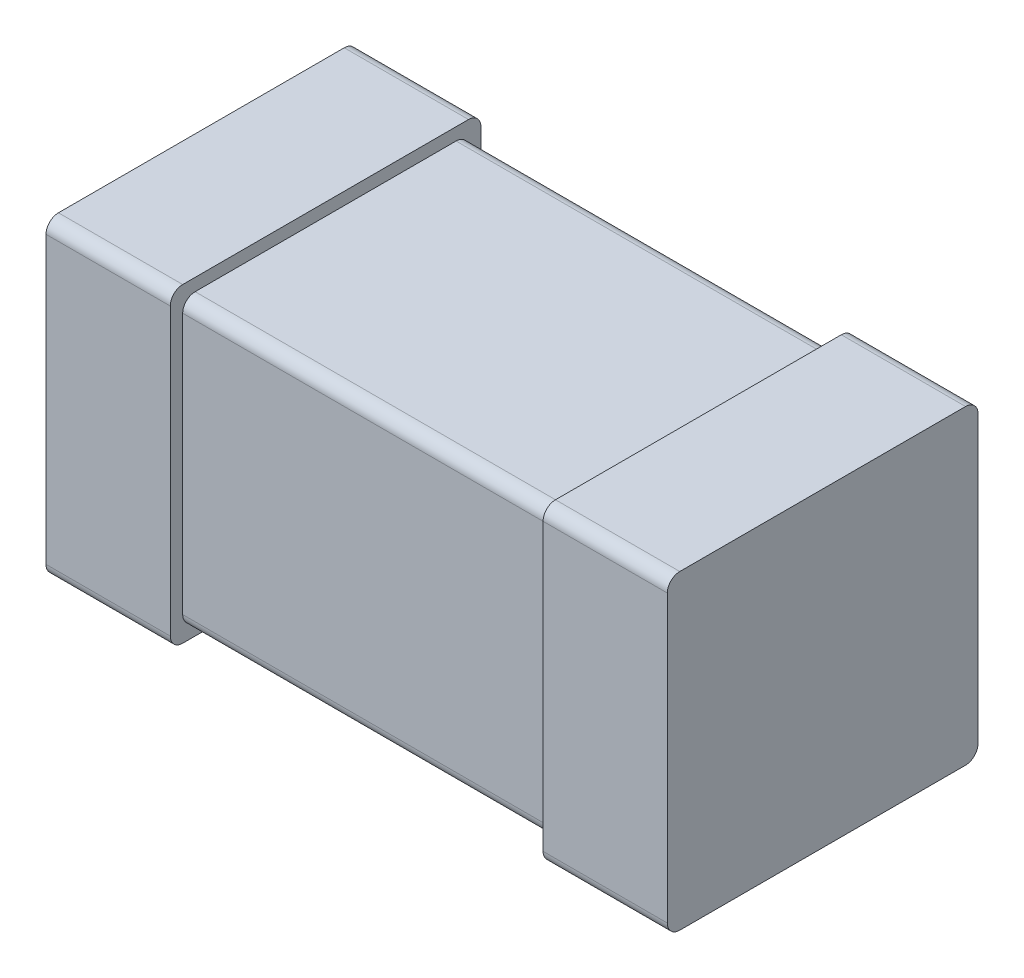
ISO-10303-21;
HEADER;
FILE_DESCRIPTION(('STEP AP214'),'2;1');
FILE_NAME('part.step','',(''),(''),'','','');
FILE_SCHEMA(('AUTOMOTIVE_DESIGN { 1 0 10303 214 1 1 1 1 }'));
ENDSEC;
DATA;
#1=APPLICATION_CONTEXT('core data for automotive mechanical design processes');
#2=APPLICATION_PROTOCOL_DEFINITION('international standard','automotive_design',2000,#1);
#3=PRODUCT_CONTEXT('',#1,'mechanical');
#4=PRODUCT('Part','Part','',(#3));
#5=PRODUCT_RELATED_PRODUCT_CATEGORY('part','',(#4));
#6=PRODUCT_DEFINITION_FORMATION('','',#4);
#7=PRODUCT_DEFINITION_CONTEXT('part definition',#1,'design');
#8=PRODUCT_DEFINITION('design','',#6,#7);
#9=PRODUCT_DEFINITION_SHAPE('','',#8);
#10=(LENGTH_UNIT() NAMED_UNIT(*) SI_UNIT(.MILLI.,.METRE.));
#11=(NAMED_UNIT(*) PLANE_ANGLE_UNIT() SI_UNIT($,.RADIAN.));
#12=(NAMED_UNIT(*) SI_UNIT($,.STERADIAN.) SOLID_ANGLE_UNIT());
#13=UNCERTAINTY_MEASURE_WITH_UNIT(LENGTH_MEASURE(1.E-05),#10,'distance_accuracy_value','');
#14=(GEOMETRIC_REPRESENTATION_CONTEXT(3) GLOBAL_UNCERTAINTY_ASSIGNED_CONTEXT((#13)) GLOBAL_UNIT_ASSIGNED_CONTEXT((#10,
#11,#12)) REPRESENTATION_CONTEXT('',''));
#15=CARTESIAN_POINT('',(0.,0.,0.));
#16=DIRECTION('',(0.,0.,1.));
#17=DIRECTION('',(1.,0.,0.));
#18=AXIS2_PLACEMENT_3D('',#15,#16,#17);
#19=CARTESIAN_POINT('',(-0.5,-0.23,0.02));
#20=DIRECTION('',(1.,0.,0.));
#21=DIRECTION('',(0.,0.,-1.));
#22=AXIS2_PLACEMENT_3D('',#19,#20,#21);
#23=CYLINDRICAL_SURFACE('',#22,0.02);
#24=CARTESIAN_POINT('',(-0.3,-0.23,0.02));
#25=DIRECTION('',(1.,0.,0.));
#26=DIRECTION('',(0.,0.,-1.));
#27=AXIS2_PLACEMENT_3D('',#24,#25,#26);
#28=CIRCLE('',#27,0.02);
#29=CARTESIAN_POINT('',(-0.3,-0.23,0.));
#30=VERTEX_POINT('',#29);
#31=CARTESIAN_POINT('',(-0.3,-0.25,0.02));
#32=VERTEX_POINT('',#31);
#33=EDGE_CURVE('E20',#30,#32,#28,.F.);
#34=ORIENTED_EDGE('',*,*,#33,.T.);
#35=DIRECTION('',(1.,0.,0.));
#36=VECTOR('',#35,1.);
#37=CARTESIAN_POINT('',(-0.5,-0.25,0.02));
#38=LINE('',#37,#36);
#39=CARTESIAN_POINT('',(-0.5,-0.25,0.02));
#40=VERTEX_POINT('',#39);
#41=EDGE_CURVE('E176',#32,#40,#38,.F.);
#42=ORIENTED_EDGE('',*,*,#41,.T.);
#43=CARTESIAN_POINT('',(-0.5,-0.23,0.02));
#44=DIRECTION('',(1.,0.,0.));
#45=DIRECTION('',(0.,0.,-1.));
#46=AXIS2_PLACEMENT_3D('',#43,#44,#45);
#47=CIRCLE('',#46,0.02);
#48=CARTESIAN_POINT('',(-0.5,-0.23,0.));
#49=VERTEX_POINT('',#48);
#50=EDGE_CURVE('E325',#40,#49,#47,.T.);
#51=ORIENTED_EDGE('',*,*,#50,.T.);
#52=DIRECTION('',(1.,0.,0.));
#53=VECTOR('',#52,1.);
#54=CARTESIAN_POINT('',(-0.5,-0.23,0.));
#55=LINE('',#54,#53);
#56=EDGE_CURVE('E178',#49,#30,#55,.T.);
#57=ORIENTED_EDGE('',*,*,#56,.T.);
#58=EDGE_LOOP('',(#34,#42,#51,#57));
#59=FACE_BOUND('',#58,.T.);
#60=ADVANCED_FACE('F17',(#59),#23,.T.);
#61=CARTESIAN_POINT('',(-0.5,0.23,0.02));
#62=DIRECTION('',(1.,0.,0.));
#63=DIRECTION('',(0.,0.,-1.));
#64=AXIS2_PLACEMENT_3D('',#61,#62,#63);
#65=CYLINDRICAL_SURFACE('',#64,0.02);
#66=DIRECTION('',(1.,0.,0.));
#67=VECTOR('',#66,1.);
#68=CARTESIAN_POINT('',(-0.5,0.23,0.));
#69=LINE('',#68,#67);
#70=CARTESIAN_POINT('',(-0.3,0.23,0.));
#71=VERTEX_POINT('',#70);
#72=CARTESIAN_POINT('',(-0.5,0.23,0.));
#73=VERTEX_POINT('',#72);
#74=EDGE_CURVE('E258',#71,#73,#69,.F.);
#75=ORIENTED_EDGE('',*,*,#74,.T.);
#76=CARTESIAN_POINT('',(-0.5,0.23,0.02));
#77=DIRECTION('',(1.,0.,0.));
#78=DIRECTION('',(0.,0.,-1.));
#79=AXIS2_PLACEMENT_3D('',#76,#77,#78);
#80=CIRCLE('',#79,0.02);
#81=CARTESIAN_POINT('',(-0.5,0.25,0.02));
#82=VERTEX_POINT('',#81);
#83=EDGE_CURVE('E322',#73,#82,#80,.T.);
#84=ORIENTED_EDGE('',*,*,#83,.T.);
#85=DIRECTION('',(1.,0.,0.));
#86=VECTOR('',#85,1.);
#87=CARTESIAN_POINT('',(-0.5,0.25,0.02));
#88=LINE('',#87,#86);
#89=CARTESIAN_POINT('',(-0.3,0.25,0.02));
#90=VERTEX_POINT('',#89);
#91=EDGE_CURVE('E255',#90,#82,#88,.F.);
#92=ORIENTED_EDGE('',*,*,#91,.F.);
#93=CARTESIAN_POINT('',(-0.3,0.23,0.02));
#94=DIRECTION('',(1.,0.,0.));
#95=DIRECTION('',(0.,0.,-1.));
#96=AXIS2_PLACEMENT_3D('',#93,#94,#95);
#97=CIRCLE('',#96,0.02);
#98=EDGE_CURVE('E180',#90,#71,#97,.F.);
#99=ORIENTED_EDGE('',*,*,#98,.T.);
#100=EDGE_LOOP('',(#75,#84,#92,#99));
#101=FACE_BOUND('',#100,.T.);
#102=ADVANCED_FACE('F329',(#101),#65,.T.);
#103=CARTESIAN_POINT('',(-0.5,-0.25,0.));
#104=DIRECTION('',(1.,0.,0.));
#105=DIRECTION('',(0.,0.,-1.));
#106=AXIS2_PLACEMENT_3D('',#103,#104,#105);
#107=PLANE('',#106);
#108=DIRECTION('',(0.,1.,0.));
#109=VECTOR('',#108,1.);
#110=CARTESIAN_POINT('',(-0.5,-0.25,0.5));
#111=LINE('',#110,#109);
#112=CARTESIAN_POINT('',(-0.5,0.23,0.5));
#113=VERTEX_POINT('',#112);
#114=CARTESIAN_POINT('',(-0.5,-0.23,0.5));
#115=VERTEX_POINT('',#114);
#116=EDGE_CURVE('E254',#113,#115,#111,.F.);
#117=ORIENTED_EDGE('',*,*,#116,.F.);
#118=CARTESIAN_POINT('',(-0.5,0.23,0.48));
#119=DIRECTION('',(1.,0.,0.));
#120=DIRECTION('',(0.,0.,-1.));
#121=AXIS2_PLACEMENT_3D('',#118,#119,#120);
#122=CIRCLE('',#121,0.02);
#123=CARTESIAN_POINT('',(-0.5,0.25,0.48));
#124=VERTEX_POINT('',#123);
#125=EDGE_CURVE('E317',#124,#113,#122,.T.);
#126=ORIENTED_EDGE('',*,*,#125,.F.);
#127=DIRECTION('',(0.,0.,1.));
#128=VECTOR('',#127,1.);
#129=CARTESIAN_POINT('',(-0.5,0.25,0.));
#130=LINE('',#129,#128);
#131=EDGE_CURVE('E257',#82,#124,#130,.T.);
#132=ORIENTED_EDGE('',*,*,#131,.F.);
#133=ORIENTED_EDGE('',*,*,#83,.F.);
#134=DIRECTION('',(0.,1.,0.));
#135=VECTOR('',#134,1.);
#136=CARTESIAN_POINT('',(-0.5,-0.25,0.));
#137=LINE('',#136,#135);
#138=EDGE_CURVE('E263',#73,#49,#137,.F.);
#139=ORIENTED_EDGE('',*,*,#138,.T.);
#140=ORIENTED_EDGE('',*,*,#50,.F.);
#141=DIRECTION('',(0.,0.,1.));
#142=VECTOR('',#141,1.);
#143=CARTESIAN_POINT('',(-0.5,-0.25,0.));
#144=LINE('',#143,#142);
#145=CARTESIAN_POINT('',(-0.5,-0.25,0.48));
#146=VERTEX_POINT('',#145);
#147=EDGE_CURVE('E188',#40,#146,#144,.T.);
#148=ORIENTED_EDGE('',*,*,#147,.T.);
#149=CARTESIAN_POINT('',(-0.5,-0.23,0.48));
#150=DIRECTION('',(1.,0.,0.));
#151=DIRECTION('',(0.,0.,-1.));
#152=AXIS2_PLACEMENT_3D('',#149,#150,#151);
#153=CIRCLE('',#152,0.02);
#154=EDGE_CURVE('E319',#115,#146,#153,.T.);
#155=ORIENTED_EDGE('',*,*,#154,.F.);
#156=EDGE_LOOP('',(#117,#126,#132,#133,#139,#140,#148,#155));
#157=FACE_BOUND('',#156,.T.);
#158=ADVANCED_FACE('F337',(#157),#107,.F.);
#159=CARTESIAN_POINT('',(-0.5,-0.23,0.48));
#160=DIRECTION('',(1.,0.,0.));
#161=DIRECTION('',(0.,0.,-1.));
#162=AXIS2_PLACEMENT_3D('',#159,#160,#161);
#163=CYLINDRICAL_SURFACE('',#162,0.02);
#164=DIRECTION('',(1.,0.,0.));
#165=VECTOR('',#164,1.);
#166=CARTESIAN_POINT('',(-0.5,-0.23,0.5));
#167=LINE('',#166,#165);
#168=CARTESIAN_POINT('',(-0.3,-0.23,0.5));
#169=VERTEX_POINT('',#168);
#170=EDGE_CURVE('E251',#115,#169,#167,.T.);
#171=ORIENTED_EDGE('',*,*,#170,.F.);
#172=ORIENTED_EDGE('',*,*,#154,.T.);
#173=DIRECTION('',(1.,0.,0.));
#174=VECTOR('',#173,1.);
#175=CARTESIAN_POINT('',(-0.5,-0.25,0.48));
#176=LINE('',#175,#174);
#177=CARTESIAN_POINT('',(-0.3,-0.25,0.48));
#178=VERTEX_POINT('',#177);
#179=EDGE_CURVE('E266',#146,#178,#176,.T.);
#180=ORIENTED_EDGE('',*,*,#179,.T.);
#181=CARTESIAN_POINT('',(-0.3,-0.23,0.48));
#182=DIRECTION('',(1.,0.,0.));
#183=DIRECTION('',(0.,0.,-1.));
#184=AXIS2_PLACEMENT_3D('',#181,#182,#183);
#185=CIRCLE('',#184,0.02);
#186=EDGE_CURVE('E193',#178,#169,#185,.F.);
#187=ORIENTED_EDGE('',*,*,#186,.T.);
#188=EDGE_LOOP('',(#171,#172,#180,#187));
#189=FACE_BOUND('',#188,.T.);
#190=ADVANCED_FACE('F480',(#189),#163,.T.);
#191=CARTESIAN_POINT('',(-0.5,0.23,0.48));
#192=DIRECTION('',(1.,0.,0.));
#193=DIRECTION('',(0.,0.,-1.));
#194=AXIS2_PLACEMENT_3D('',#191,#192,#193);
#195=CYLINDRICAL_SURFACE('',#194,0.02);
#196=CARTESIAN_POINT('',(-0.3,0.23,0.48));
#197=DIRECTION('',(1.,0.,0.));
#198=DIRECTION('',(0.,0.,-1.));
#199=AXIS2_PLACEMENT_3D('',#196,#197,#198);
#200=CIRCLE('',#199,0.02);
#201=CARTESIAN_POINT('',(-0.3,0.23,0.5));
#202=VERTEX_POINT('',#201);
#203=CARTESIAN_POINT('',(-0.3,0.25,0.48));
#204=VERTEX_POINT('',#203);
#205=EDGE_CURVE('E315',#202,#204,#200,.F.);
#206=ORIENTED_EDGE('',*,*,#205,.T.);
#207=DIRECTION('',(1.,0.,0.));
#208=VECTOR('',#207,1.);
#209=CARTESIAN_POINT('',(-0.5,0.25,0.48));
#210=LINE('',#209,#208);
#211=EDGE_CURVE('E259',#124,#204,#210,.T.);
#212=ORIENTED_EDGE('',*,*,#211,.F.);
#213=ORIENTED_EDGE('',*,*,#125,.T.);
#214=DIRECTION('',(1.,0.,0.));
#215=VECTOR('',#214,1.);
#216=CARTESIAN_POINT('',(-0.5,0.23,0.5));
#217=LINE('',#216,#215);
#218=EDGE_CURVE('E248',#202,#113,#217,.F.);
#219=ORIENTED_EDGE('',*,*,#218,.F.);
#220=EDGE_LOOP('',(#206,#212,#213,#219));
#221=FACE_BOUND('',#220,.T.);
#222=ADVANCED_FACE('F476',(#221),#195,.T.);
#223=CARTESIAN_POINT('',(0.3,-0.23,0.02));
#224=DIRECTION('',(1.,0.,0.));
#225=DIRECTION('',(0.,0.,-1.));
#226=AXIS2_PLACEMENT_3D('',#223,#224,#225);
#227=CYLINDRICAL_SURFACE('',#226,0.02);
#228=CARTESIAN_POINT('',(0.5,-0.23,0.02));
#229=DIRECTION('',(1.,0.,0.));
#230=DIRECTION('',(0.,0.,-1.));
#231=AXIS2_PLACEMENT_3D('',#228,#229,#230);
#232=CIRCLE('',#231,0.02);
#233=CARTESIAN_POINT('',(0.5,-0.25,0.02));
#234=VERTEX_POINT('',#233);
#235=CARTESIAN_POINT('',(0.5,-0.23,0.));
#236=VERTEX_POINT('',#235);
#237=EDGE_CURVE('E307',#234,#236,#232,.T.);
#238=ORIENTED_EDGE('',*,*,#237,.F.);
#239=DIRECTION('',(1.,0.,0.));
#240=VECTOR('',#239,1.);
#241=CARTESIAN_POINT('',(0.3,-0.25,0.02));
#242=LINE('',#241,#240);
#243=CARTESIAN_POINT('',(0.3,-0.25,0.02));
#244=VERTEX_POINT('',#243);
#245=EDGE_CURVE('E244',#234,#244,#242,.F.);
#246=ORIENTED_EDGE('',*,*,#245,.T.);
#247=CARTESIAN_POINT('',(0.3,-0.23,0.02));
#248=DIRECTION('',(1.,0.,0.));
#249=DIRECTION('',(0.,0.,-1.));
#250=AXIS2_PLACEMENT_3D('',#247,#248,#249);
#251=CIRCLE('',#250,0.02);
#252=CARTESIAN_POINT('',(0.3,-0.23,0.));
#253=VERTEX_POINT('',#252);
#254=EDGE_CURVE('E313',#244,#253,#251,.T.);
#255=ORIENTED_EDGE('',*,*,#254,.T.);
#256=DIRECTION('',(1.,0.,0.));
#257=VECTOR('',#256,1.);
#258=CARTESIAN_POINT('',(0.3,-0.23,0.));
#259=LINE('',#258,#257);
#260=EDGE_CURVE('E234',#253,#236,#259,.T.);
#261=ORIENTED_EDGE('',*,*,#260,.T.);
#262=EDGE_LOOP('',(#238,#246,#255,#261));
#263=FACE_BOUND('',#262,.T.);
#264=ADVANCED_FACE('F472',(#263),#227,.T.);
#265=CARTESIAN_POINT('',(0.3,0.23,0.02));
#266=DIRECTION('',(1.,0.,0.));
#267=DIRECTION('',(0.,0.,-1.));
#268=AXIS2_PLACEMENT_3D('',#265,#266,#267);
#269=CYLINDRICAL_SURFACE('',#268,0.02);
#270=DIRECTION('',(1.,0.,0.));
#271=VECTOR('',#270,1.);
#272=CARTESIAN_POINT('',(0.3,0.23,0.));
#273=LINE('',#272,#271);
#274=CARTESIAN_POINT('',(0.5,0.23,0.));
#275=VERTEX_POINT('',#274);
#276=CARTESIAN_POINT('',(0.3,0.23,0.));
#277=VERTEX_POINT('',#276);
#278=EDGE_CURVE('E239',#275,#277,#273,.F.);
#279=ORIENTED_EDGE('',*,*,#278,.T.);
#280=CARTESIAN_POINT('',(0.3,0.23,0.02));
#281=DIRECTION('',(1.,0.,0.));
#282=DIRECTION('',(0.,0.,-1.));
#283=AXIS2_PLACEMENT_3D('',#280,#281,#282);
#284=CIRCLE('',#283,0.02);
#285=CARTESIAN_POINT('',(0.3,0.25,0.02));
#286=VERTEX_POINT('',#285);
#287=EDGE_CURVE('E311',#277,#286,#284,.T.);
#288=ORIENTED_EDGE('',*,*,#287,.T.);
#289=DIRECTION('',(1.,0.,0.));
#290=VECTOR('',#289,1.);
#291=CARTESIAN_POINT('',(0.3,0.25,0.02));
#292=LINE('',#291,#290);
#293=CARTESIAN_POINT('',(0.5,0.25,0.02));
#294=VERTEX_POINT('',#293);
#295=EDGE_CURVE('E228',#294,#286,#292,.F.);
#296=ORIENTED_EDGE('',*,*,#295,.F.);
#297=CARTESIAN_POINT('',(0.5,0.23,0.02));
#298=DIRECTION('',(1.,0.,0.));
#299=DIRECTION('',(0.,0.,-1.));
#300=AXIS2_PLACEMENT_3D('',#297,#298,#299);
#301=CIRCLE('',#300,0.02);
#302=EDGE_CURVE('E305',#275,#294,#301,.T.);
#303=ORIENTED_EDGE('',*,*,#302,.F.);
#304=EDGE_LOOP('',(#279,#288,#296,#303));
#305=FACE_BOUND('',#304,.T.);
#306=ADVANCED_FACE('F468',(#305),#269,.T.);
#307=CARTESIAN_POINT('',(0.3,-0.23,0.48));
#308=DIRECTION('',(1.,0.,0.));
#309=DIRECTION('',(0.,0.,-1.));
#310=AXIS2_PLACEMENT_3D('',#307,#308,#309);
#311=CYLINDRICAL_SURFACE('',#310,0.02);
#312=DIRECTION('',(1.,0.,0.));
#313=VECTOR('',#312,1.);
#314=CARTESIAN_POINT('',(0.3,-0.23,0.5));
#315=LINE('',#314,#313);
#316=CARTESIAN_POINT('',(0.3,-0.23,0.5));
#317=VERTEX_POINT('',#316);
#318=CARTESIAN_POINT('',(0.5,-0.23,0.5));
#319=VERTEX_POINT('',#318);
#320=EDGE_CURVE('E225',#317,#319,#315,.T.);
#321=ORIENTED_EDGE('',*,*,#320,.F.);
#322=CARTESIAN_POINT('',(0.3,-0.23,0.48));
#323=DIRECTION('',(1.,0.,0.));
#324=DIRECTION('',(0.,0.,-1.));
#325=AXIS2_PLACEMENT_3D('',#322,#323,#324);
#326=CIRCLE('',#325,0.02);
#327=CARTESIAN_POINT('',(0.3,-0.25,0.48));
#328=VERTEX_POINT('',#327);
#329=EDGE_CURVE('E309',#317,#328,#326,.T.);
#330=ORIENTED_EDGE('',*,*,#329,.T.);
#331=DIRECTION('',(1.,0.,0.));
#332=VECTOR('',#331,1.);
#333=CARTESIAN_POINT('',(0.3,-0.25,0.48));
#334=LINE('',#333,#332);
#335=CARTESIAN_POINT('',(0.5,-0.25,0.48));
#336=VERTEX_POINT('',#335);
#337=EDGE_CURVE('E238',#328,#336,#334,.T.);
#338=ORIENTED_EDGE('',*,*,#337,.T.);
#339=CARTESIAN_POINT('',(0.5,-0.23,0.48));
#340=DIRECTION('',(1.,0.,0.));
#341=DIRECTION('',(0.,0.,-1.));
#342=AXIS2_PLACEMENT_3D('',#339,#340,#341);
#343=CIRCLE('',#342,0.02);
#344=EDGE_CURVE('E303',#319,#336,#343,.T.);
#345=ORIENTED_EDGE('',*,*,#344,.F.);
#346=EDGE_LOOP('',(#321,#330,#338,#345));
#347=FACE_BOUND('',#346,.T.);
#348=ADVANCED_FACE('F464',(#347),#311,.T.);
#349=CARTESIAN_POINT('',(0.5,-0.25,0.));
#350=DIRECTION('',(1.,0.,0.));
#351=DIRECTION('',(0.,0.,-1.));
#352=AXIS2_PLACEMENT_3D('',#349,#350,#351);
#353=PLANE('',#352);
#354=DIRECTION('',(0.,1.,0.));
#355=VECTOR('',#354,1.);
#356=CARTESIAN_POINT('',(0.5,-0.25,0.5));
#357=LINE('',#356,#355);
#358=CARTESIAN_POINT('',(0.5,0.23,0.5));
#359=VERTEX_POINT('',#358);
#360=EDGE_CURVE('E224',#319,#359,#357,.T.);
#361=ORIENTED_EDGE('',*,*,#360,.F.);
#362=ORIENTED_EDGE('',*,*,#344,.T.);
#363=DIRECTION('',(0.,0.,1.));
#364=VECTOR('',#363,1.);
#365=CARTESIAN_POINT('',(0.5,-0.25,0.));
#366=LINE('',#365,#364);
#367=EDGE_CURVE('E247',#336,#234,#366,.F.);
#368=ORIENTED_EDGE('',*,*,#367,.T.);
#369=ORIENTED_EDGE('',*,*,#237,.T.);
#370=DIRECTION('',(0.,1.,0.));
#371=VECTOR('',#370,1.);
#372=CARTESIAN_POINT('',(0.5,-0.25,0.));
#373=LINE('',#372,#371);
#374=EDGE_CURVE('E237',#236,#275,#373,.T.);
#375=ORIENTED_EDGE('',*,*,#374,.T.);
#376=ORIENTED_EDGE('',*,*,#302,.T.);
#377=DIRECTION('',(0.,0.,1.));
#378=VECTOR('',#377,1.);
#379=CARTESIAN_POINT('',(0.5,0.25,0.));
#380=LINE('',#379,#378);
#381=CARTESIAN_POINT('',(0.5,0.25,0.48));
#382=VERTEX_POINT('',#381);
#383=EDGE_CURVE('E231',#382,#294,#380,.F.);
#384=ORIENTED_EDGE('',*,*,#383,.F.);
#385=CARTESIAN_POINT('',(0.5,0.23,0.48));
#386=DIRECTION('',(1.,0.,0.));
#387=DIRECTION('',(0.,0.,-1.));
#388=AXIS2_PLACEMENT_3D('',#385,#386,#387);
#389=CIRCLE('',#388,0.02);
#390=EDGE_CURVE('E299',#359,#382,#389,.F.);
#391=ORIENTED_EDGE('',*,*,#390,.F.);
#392=EDGE_LOOP('',(#361,#362,#368,#369,#375,#376,#384,#391));
#393=FACE_BOUND('',#392,.T.);
#394=ADVANCED_FACE('F460',(#393),#353,.T.);
#395=CARTESIAN_POINT('',(0.3,0.23,0.48));
#396=DIRECTION('',(1.,0.,0.));
#397=DIRECTION('',(0.,0.,-1.));
#398=AXIS2_PLACEMENT_3D('',#395,#396,#397);
#399=CYLINDRICAL_SURFACE('',#398,0.02);
#400=ORIENTED_EDGE('',*,*,#390,.T.);
#401=DIRECTION('',(1.,0.,0.));
#402=VECTOR('',#401,1.);
#403=CARTESIAN_POINT('',(0.3,0.25,0.48));
#404=LINE('',#403,#402);
#405=CARTESIAN_POINT('',(0.3,0.25,0.48));
#406=VERTEX_POINT('',#405);
#407=EDGE_CURVE('E227',#406,#382,#404,.T.);
#408=ORIENTED_EDGE('',*,*,#407,.F.);
#409=CARTESIAN_POINT('',(0.3,0.23,0.48));
#410=DIRECTION('',(1.,0.,0.));
#411=DIRECTION('',(0.,0.,-1.));
#412=AXIS2_PLACEMENT_3D('',#409,#410,#411);
#413=CIRCLE('',#412,0.02);
#414=CARTESIAN_POINT('',(0.3,0.23,0.5));
#415=VERTEX_POINT('',#414);
#416=EDGE_CURVE('E301',#406,#415,#413,.T.);
#417=ORIENTED_EDGE('',*,*,#416,.T.);
#418=DIRECTION('',(1.,0.,0.));
#419=VECTOR('',#418,1.);
#420=CARTESIAN_POINT('',(0.3,0.23,0.5));
#421=LINE('',#420,#419);
#422=EDGE_CURVE('E216',#359,#415,#421,.F.);
#423=ORIENTED_EDGE('',*,*,#422,.F.);
#424=EDGE_LOOP('',(#400,#408,#417,#423));
#425=FACE_BOUND('',#424,.T.);
#426=ADVANCED_FACE('F456',(#425),#399,.T.);
#427=CARTESIAN_POINT('',(-0.3,-0.21,0.46));
#428=DIRECTION('',(1.,0.,0.));
#429=DIRECTION('',(0.,0.,-1.));
#430=AXIS2_PLACEMENT_3D('',#427,#428,#429);
#431=CYLINDRICAL_SURFACE('',#430,0.02);
#432=DIRECTION('',(1.,0.,0.));
#433=VECTOR('',#432,1.);
#434=CARTESIAN_POINT('',(-0.3,-0.21,0.48));
#435=LINE('',#434,#433);
#436=CARTESIAN_POINT('',(-0.3,-0.21,0.48));
#437=VERTEX_POINT('',#436);
#438=CARTESIAN_POINT('',(0.3,-0.21,0.48));
#439=VERTEX_POINT('',#438);
#440=EDGE_CURVE('E208',#437,#439,#435,.T.);
#441=ORIENTED_EDGE('',*,*,#440,.F.);
#442=CARTESIAN_POINT('',(-0.3,-0.21,0.46));
#443=DIRECTION('',(1.,0.,0.));
#444=DIRECTION('',(0.,0.,-1.));
#445=AXIS2_PLACEMENT_3D('',#442,#443,#444);
#446=CIRCLE('',#445,0.02);
#447=CARTESIAN_POINT('',(-0.3,-0.23,0.46));
#448=VERTEX_POINT('',#447);
#449=EDGE_CURVE('E295',#437,#448,#446,.T.);
#450=ORIENTED_EDGE('',*,*,#449,.T.);
#451=DIRECTION('',(1.,0.,0.));
#452=VECTOR('',#451,1.);
#453=CARTESIAN_POINT('',(-0.3,-0.23,0.46));
#454=LINE('',#453,#452);
#455=CARTESIAN_POINT('',(0.3,-0.23,0.46));
#456=VERTEX_POINT('',#455);
#457=EDGE_CURVE('E211',#448,#456,#454,.T.);
#458=ORIENTED_EDGE('',*,*,#457,.T.);
#459=CARTESIAN_POINT('',(0.3,-0.21,0.46));
#460=DIRECTION('',(1.,0.,0.));
#461=DIRECTION('',(0.,0.,-1.));
#462=AXIS2_PLACEMENT_3D('',#459,#460,#461);
#463=CIRCLE('',#462,0.02);
#464=EDGE_CURVE('E297',#456,#439,#463,.F.);
#465=ORIENTED_EDGE('',*,*,#464,.T.);
#466=EDGE_LOOP('',(#441,#450,#458,#465));
#467=FACE_BOUND('',#466,.T.);
#468=ADVANCED_FACE('F452',(#467),#431,.T.);
#469=CARTESIAN_POINT('',(-0.3,0.21,0.46));
#470=DIRECTION('',(1.,0.,0.));
#471=DIRECTION('',(0.,0.,-1.));
#472=AXIS2_PLACEMENT_3D('',#469,#470,#471);
#473=CYLINDRICAL_SURFACE('',#472,0.02);
#474=CARTESIAN_POINT('',(0.3,0.21,0.46));
#475=DIRECTION('',(1.,0.,0.));
#476=DIRECTION('',(0.,0.,-1.));
#477=AXIS2_PLACEMENT_3D('',#474,#475,#476);
#478=CIRCLE('',#477,0.02);
#479=CARTESIAN_POINT('',(0.3,0.21,0.48));
#480=VERTEX_POINT('',#479);
#481=CARTESIAN_POINT('',(0.3,0.23,0.46));
#482=VERTEX_POINT('',#481);
#483=EDGE_CURVE('E189',#480,#482,#478,.F.);
#484=ORIENTED_EDGE('',*,*,#483,.T.);
#485=DIRECTION('',(1.,0.,0.));
#486=VECTOR('',#485,1.);
#487=CARTESIAN_POINT('',(-0.3,0.23,0.46));
#488=LINE('',#487,#486);
#489=CARTESIAN_POINT('',(-0.3,0.23,0.46));
#490=VERTEX_POINT('',#489);
#491=EDGE_CURVE('E196',#490,#482,#488,.T.);
#492=ORIENTED_EDGE('',*,*,#491,.F.);
#493=CARTESIAN_POINT('',(-0.3,0.21,0.46));
#494=DIRECTION('',(1.,0.,0.));
#495=DIRECTION('',(0.,0.,-1.));
#496=AXIS2_PLACEMENT_3D('',#493,#494,#495);
#497=CIRCLE('',#496,0.02);
#498=CARTESIAN_POINT('',(-0.3,0.21,0.48));
#499=VERTEX_POINT('',#498);
#500=EDGE_CURVE('E293',#490,#499,#497,.T.);
#501=ORIENTED_EDGE('',*,*,#500,.T.);
#502=DIRECTION('',(1.,0.,0.));
#503=VECTOR('',#502,1.);
#504=CARTESIAN_POINT('',(-0.3,0.21,0.48));
#505=LINE('',#504,#503);
#506=EDGE_CURVE('E201',#480,#499,#505,.F.);
#507=ORIENTED_EDGE('',*,*,#506,.F.);
#508=EDGE_LOOP('',(#484,#492,#501,#507));
#509=FACE_BOUND('',#508,.T.);
#510=ADVANCED_FACE('F449',(#509),#473,.T.);
#511=CARTESIAN_POINT('',(-0.5,-0.25,0.));
#512=DIRECTION('',(0.,1.,0.));
#513=DIRECTION('',(0.,0.,1.));
#514=AXIS2_PLACEMENT_3D('',#511,#512,#513);
#515=PLANE('',#514);
#516=ORIENTED_EDGE('',*,*,#147,.F.);
#517=ORIENTED_EDGE('',*,*,#41,.F.);
#518=DIRECTION('',(0.,0.,-1.));
#519=VECTOR('',#518,1.);
#520=CARTESIAN_POINT('',(-0.3,-0.25,0.));
#521=LINE('',#520,#519);
#522=EDGE_CURVE('E186',#178,#32,#521,.T.);
#523=ORIENTED_EDGE('',*,*,#522,.F.);
#524=ORIENTED_EDGE('',*,*,#179,.F.);
#525=EDGE_LOOP('',(#516,#517,#523,#524));
#526=FACE_BOUND('',#525,.T.);
#527=ADVANCED_FACE('F184',(#526),#515,.F.);
#528=CARTESIAN_POINT('',(-0.5,-0.25,0.));
#529=DIRECTION('',(0.,0.,1.));
#530=DIRECTION('',(1.,0.,0.));
#531=AXIS2_PLACEMENT_3D('',#528,#529,#530);
#532=PLANE('',#531);
#533=DIRECTION('',(0.,1.,0.));
#534=VECTOR('',#533,1.);
#535=CARTESIAN_POINT('',(-0.3,-0.25,0.));
#536=LINE('',#535,#534);
#537=EDGE_CURVE('E195',#30,#71,#536,.T.);
#538=ORIENTED_EDGE('',*,*,#537,.F.);
#539=ORIENTED_EDGE('',*,*,#56,.F.);
#540=ORIENTED_EDGE('',*,*,#138,.F.);
#541=ORIENTED_EDGE('',*,*,#74,.F.);
#542=EDGE_LOOP('',(#538,#539,#540,#541));
#543=FACE_BOUND('',#542,.T.);
#544=ADVANCED_FACE('F334',(#543),#532,.F.);
#545=CARTESIAN_POINT('',(-0.5,0.25,0.));
#546=DIRECTION('',(0.,1.,0.));
#547=DIRECTION('',(0.,0.,1.));
#548=AXIS2_PLACEMENT_3D('',#545,#546,#547);
#549=PLANE('',#548);
#550=ORIENTED_EDGE('',*,*,#131,.T.);
#551=ORIENTED_EDGE('',*,*,#211,.T.);
#552=DIRECTION('',(0.,0.,-1.));
#553=VECTOR('',#552,1.);
#554=CARTESIAN_POINT('',(-0.3,0.25,0.));
#555=LINE('',#554,#553);
#556=EDGE_CURVE('E198',#90,#204,#555,.F.);
#557=ORIENTED_EDGE('',*,*,#556,.F.);
#558=ORIENTED_EDGE('',*,*,#91,.T.);
#559=EDGE_LOOP('',(#550,#551,#557,#558));
#560=FACE_BOUND('',#559,.T.);
#561=ADVANCED_FACE('F342',(#560),#549,.T.);
#562=CARTESIAN_POINT('',(-0.5,-0.25,0.5));
#563=DIRECTION('',(0.,0.,1.));
#564=DIRECTION('',(1.,0.,0.));
#565=AXIS2_PLACEMENT_3D('',#562,#563,#564);
#566=PLANE('',#565);
#567=DIRECTION('',(0.,1.,0.));
#568=VECTOR('',#567,1.);
#569=CARTESIAN_POINT('',(-0.3,-0.25,0.5));
#570=LINE('',#569,#568);
#571=EDGE_CURVE('E343',#202,#169,#570,.F.);
#572=ORIENTED_EDGE('',*,*,#571,.F.);
#573=ORIENTED_EDGE('',*,*,#218,.T.);
#574=ORIENTED_EDGE('',*,*,#116,.T.);
#575=ORIENTED_EDGE('',*,*,#170,.T.);
#576=EDGE_LOOP('',(#572,#573,#574,#575));
#577=FACE_BOUND('',#576,.T.);
#578=ADVANCED_FACE('F438',(#577),#566,.T.);
#579=CARTESIAN_POINT('',(0.3,-0.25,0.));
#580=DIRECTION('',(0.,1.,0.));
#581=DIRECTION('',(0.,0.,1.));
#582=AXIS2_PLACEMENT_3D('',#579,#580,#581);
#583=PLANE('',#582);
#584=DIRECTION('',(0.,0.,-1.));
#585=VECTOR('',#584,1.);
#586=CARTESIAN_POINT('',(0.3,-0.25,0.));
#587=LINE('',#586,#585);
#588=EDGE_CURVE('E220',#328,#244,#587,.T.);
#589=ORIENTED_EDGE('',*,*,#588,.T.);
#590=ORIENTED_EDGE('',*,*,#245,.F.);
#591=ORIENTED_EDGE('',*,*,#367,.F.);
#592=ORIENTED_EDGE('',*,*,#337,.F.);
#593=EDGE_LOOP('',(#589,#590,#591,#592));
#594=FACE_BOUND('',#593,.T.);
#595=ADVANCED_FACE('F434',(#594),#583,.F.);
#596=CARTESIAN_POINT('',(0.3,-0.25,0.));
#597=DIRECTION('',(0.,0.,1.));
#598=DIRECTION('',(1.,0.,0.));
#599=AXIS2_PLACEMENT_3D('',#596,#597,#598);
#600=PLANE('',#599);
#601=ORIENTED_EDGE('',*,*,#374,.F.);
#602=ORIENTED_EDGE('',*,*,#260,.F.);
#603=DIRECTION('',(0.,1.,0.));
#604=VECTOR('',#603,1.);
#605=CARTESIAN_POINT('',(0.3,-0.25,0.));
#606=LINE('',#605,#604);
#607=EDGE_CURVE('E363',#253,#277,#606,.T.);
#608=ORIENTED_EDGE('',*,*,#607,.T.);
#609=ORIENTED_EDGE('',*,*,#278,.F.);
#610=EDGE_LOOP('',(#601,#602,#608,#609));
#611=FACE_BOUND('',#610,.T.);
#612=ADVANCED_FACE('F430',(#611),#600,.F.);
#613=CARTESIAN_POINT('',(0.3,0.25,0.));
#614=DIRECTION('',(0.,1.,0.));
#615=DIRECTION('',(0.,0.,1.));
#616=AXIS2_PLACEMENT_3D('',#613,#614,#615);
#617=PLANE('',#616);
#618=DIRECTION('',(0.,0.,-1.));
#619=VECTOR('',#618,1.);
#620=CARTESIAN_POINT('',(0.3,0.25,0.));
#621=LINE('',#620,#619);
#622=EDGE_CURVE('E366',#286,#406,#621,.F.);
#623=ORIENTED_EDGE('',*,*,#622,.T.);
#624=ORIENTED_EDGE('',*,*,#407,.T.);
#625=ORIENTED_EDGE('',*,*,#383,.T.);
#626=ORIENTED_EDGE('',*,*,#295,.T.);
#627=EDGE_LOOP('',(#623,#624,#625,#626));
#628=FACE_BOUND('',#627,.T.);
#629=ADVANCED_FACE('F426',(#628),#617,.T.);
#630=CARTESIAN_POINT('',(0.3,-0.25,0.5));
#631=DIRECTION('',(0.,0.,1.));
#632=DIRECTION('',(1.,0.,0.));
#633=AXIS2_PLACEMENT_3D('',#630,#631,#632);
#634=PLANE('',#633);
#635=ORIENTED_EDGE('',*,*,#360,.T.);
#636=ORIENTED_EDGE('',*,*,#422,.T.);
#637=DIRECTION('',(0.,1.,0.));
#638=VECTOR('',#637,1.);
#639=CARTESIAN_POINT('',(0.3,-0.25,0.5));
#640=LINE('',#639,#638);
#641=EDGE_CURVE('E289',#415,#317,#640,.F.);
#642=ORIENTED_EDGE('',*,*,#641,.T.);
#643=ORIENTED_EDGE('',*,*,#320,.T.);
#644=EDGE_LOOP('',(#635,#636,#642,#643));
#645=FACE_BOUND('',#644,.T.);
#646=ADVANCED_FACE('F422',(#645),#634,.T.);
#647=CARTESIAN_POINT('',(-0.3,-0.23,0.02));
#648=DIRECTION('',(0.,1.,0.));
#649=DIRECTION('',(0.,0.,1.));
#650=AXIS2_PLACEMENT_3D('',#647,#648,#649);
#651=PLANE('',#650);
#652=DIRECTION('',(0.,0.,-1.));
#653=VECTOR('',#652,1.);
#654=CARTESIAN_POINT('',(-0.3,-0.23,0.));
#655=LINE('',#654,#653);
#656=CARTESIAN_POINT('',(-0.3,-0.23,0.04));
#657=VERTEX_POINT('',#656);
#658=EDGE_CURVE('E344',#657,#448,#655,.F.);
#659=ORIENTED_EDGE('',*,*,#658,.F.);
#660=DIRECTION('',(1.,0.,0.));
#661=VECTOR('',#660,1.);
#662=CARTESIAN_POINT('',(-0.3,-0.23,0.04));
#663=LINE('',#662,#661);
#664=CARTESIAN_POINT('',(0.3,-0.23,0.04));
#665=VERTEX_POINT('',#664);
#666=EDGE_CURVE('E217',#665,#657,#663,.F.);
#667=ORIENTED_EDGE('',*,*,#666,.F.);
#668=DIRECTION('',(0.,0.,-1.));
#669=VECTOR('',#668,1.);
#670=CARTESIAN_POINT('',(0.3,-0.23,0.));
#671=LINE('',#670,#669);
#672=EDGE_CURVE('E288',#665,#456,#671,.F.);
#673=ORIENTED_EDGE('',*,*,#672,.T.);
#674=ORIENTED_EDGE('',*,*,#457,.F.);
#675=EDGE_LOOP('',(#659,#667,#673,#674));
#676=FACE_BOUND('',#675,.T.);
#677=ADVANCED_FACE('F418',(#676),#651,.F.);
#678=CARTESIAN_POINT('',(-0.3,-0.23,0.48));
#679=DIRECTION('',(0.,0.,1.));
#680=DIRECTION('',(1.,0.,0.));
#681=AXIS2_PLACEMENT_3D('',#678,#679,#680);
#682=PLANE('',#681);
#683=DIRECTION('',(0.,1.,0.));
#684=VECTOR('',#683,1.);
#685=CARTESIAN_POINT('',(0.3,-0.25,0.48));
#686=LINE('',#685,#684);
#687=EDGE_CURVE('E373',#439,#480,#686,.T.);
#688=ORIENTED_EDGE('',*,*,#687,.T.);
#689=ORIENTED_EDGE('',*,*,#506,.T.);
#690=DIRECTION('',(0.,1.,0.));
#691=VECTOR('',#690,1.);
#692=CARTESIAN_POINT('',(-0.3,-0.25,0.48));
#693=LINE('',#692,#691);
#694=EDGE_CURVE('E349',#437,#499,#693,.T.);
#695=ORIENTED_EDGE('',*,*,#694,.F.);
#696=ORIENTED_EDGE('',*,*,#440,.T.);
#697=EDGE_LOOP('',(#688,#689,#695,#696));
#698=FACE_BOUND('',#697,.T.);
#699=ADVANCED_FACE('F415',(#698),#682,.T.);
#700=CARTESIAN_POINT('',(-0.3,0.23,0.02));
#701=DIRECTION('',(0.,1.,0.));
#702=DIRECTION('',(0.,0.,1.));
#703=AXIS2_PLACEMENT_3D('',#700,#701,#702);
#704=PLANE('',#703);
#705=DIRECTION('',(0.,0.,-1.));
#706=VECTOR('',#705,1.);
#707=CARTESIAN_POINT('',(-0.3,0.23,0.));
#708=LINE('',#707,#706);
#709=CARTESIAN_POINT('',(-0.3,0.23,0.04));
#710=VERTEX_POINT('',#709);
#711=EDGE_CURVE('E291',#490,#710,#708,.T.);
#712=ORIENTED_EDGE('',*,*,#711,.F.);
#713=ORIENTED_EDGE('',*,*,#491,.T.);
#714=DIRECTION('',(0.,0.,-1.));
#715=VECTOR('',#714,1.);
#716=CARTESIAN_POINT('',(0.3,0.23,0.));
#717=LINE('',#716,#715);
#718=CARTESIAN_POINT('',(0.3,0.23,0.04));
#719=VERTEX_POINT('',#718);
#720=EDGE_CURVE('E206',#482,#719,#717,.T.);
#721=ORIENTED_EDGE('',*,*,#720,.T.);
#722=DIRECTION('',(1.,0.,0.));
#723=VECTOR('',#722,1.);
#724=CARTESIAN_POINT('',(-0.3,0.23,0.04));
#725=LINE('',#724,#723);
#726=EDGE_CURVE('E205',#710,#719,#725,.T.);
#727=ORIENTED_EDGE('',*,*,#726,.F.);
#728=EDGE_LOOP('',(#712,#713,#721,#727));
#729=FACE_BOUND('',#728,.T.);
#730=ADVANCED_FACE('F381',(#729),#704,.T.);
#731=CARTESIAN_POINT('',(-0.3,-0.25,0.));
#732=DIRECTION('',(1.,0.,0.));
#733=DIRECTION('',(0.,0.,-1.));
#734=AXIS2_PLACEMENT_3D('',#731,#732,#733);
#735=PLANE('',#734);
#736=CARTESIAN_POINT('',(-0.3,0.21,0.04));
#737=DIRECTION('',(1.,0.,0.));
#738=DIRECTION('',(0.,0.,-1.));
#739=AXIS2_PLACEMENT_3D('',#736,#737,#738);
#740=CIRCLE('',#739,0.02);
#741=CARTESIAN_POINT('',(-0.3,0.21,0.02));
#742=VERTEX_POINT('',#741);
#743=EDGE_CURVE('E280',#742,#710,#740,.T.);
#744=ORIENTED_EDGE('',*,*,#743,.F.);
#745=DIRECTION('',(0.,1.,0.));
#746=VECTOR('',#745,1.);
#747=CARTESIAN_POINT('',(-0.3,-0.23,0.02));
#748=LINE('',#747,#746);
#749=CARTESIAN_POINT('',(-0.3,-0.21,0.02));
#750=VERTEX_POINT('',#749);
#751=EDGE_CURVE('E283',#742,#750,#748,.F.);
#752=ORIENTED_EDGE('',*,*,#751,.T.);
#753=CARTESIAN_POINT('',(-0.3,-0.21,0.04));
#754=DIRECTION('',(1.,0.,0.));
#755=DIRECTION('',(0.,0.,-1.));
#756=AXIS2_PLACEMENT_3D('',#753,#754,#755);
#757=CIRCLE('',#756,0.02);
#758=EDGE_CURVE('E221',#657,#750,#757,.T.);
#759=ORIENTED_EDGE('',*,*,#758,.F.);
#760=ORIENTED_EDGE('',*,*,#658,.T.);
#761=ORIENTED_EDGE('',*,*,#449,.F.);
#762=ORIENTED_EDGE('',*,*,#694,.T.);
#763=ORIENTED_EDGE('',*,*,#500,.F.);
#764=ORIENTED_EDGE('',*,*,#711,.T.);
#765=EDGE_LOOP('',(#744,#752,#759,#760,#761,#762,#763,#764));
#766=FACE_BOUND('',#765,.T.);
#767=ORIENTED_EDGE('',*,*,#571,.T.);
#768=ORIENTED_EDGE('',*,*,#186,.F.);
#769=ORIENTED_EDGE('',*,*,#522,.T.);
#770=ORIENTED_EDGE('',*,*,#33,.F.);
#771=ORIENTED_EDGE('',*,*,#537,.T.);
#772=ORIENTED_EDGE('',*,*,#98,.F.);
#773=ORIENTED_EDGE('',*,*,#556,.T.);
#774=ORIENTED_EDGE('',*,*,#205,.F.);
#775=EDGE_LOOP('',(#767,#768,#769,#770,#771,#772,#773,#774));
#776=FACE_BOUND('',#775,.T.);
#777=ADVANCED_FACE('F192',(#766,#776),#735,.T.);
#778=CARTESIAN_POINT('',(-0.3,-0.21,0.04));
#779=DIRECTION('',(1.,0.,0.));
#780=DIRECTION('',(0.,0.,-1.));
#781=AXIS2_PLACEMENT_3D('',#778,#779,#780);
#782=CYLINDRICAL_SURFACE('',#781,0.02);
#783=CARTESIAN_POINT('',(0.3,-0.21,0.04));
#784=DIRECTION('',(1.,0.,0.));
#785=DIRECTION('',(0.,0.,-1.));
#786=AXIS2_PLACEMENT_3D('',#783,#784,#785);
#787=CIRCLE('',#786,0.02);
#788=CARTESIAN_POINT('',(0.3,-0.21,0.02));
#789=VERTEX_POINT('',#788);
#790=EDGE_CURVE('E285',#789,#665,#787,.F.);
#791=ORIENTED_EDGE('',*,*,#790,.T.);
#792=ORIENTED_EDGE('',*,*,#666,.T.);
#793=ORIENTED_EDGE('',*,*,#758,.T.);
#794=DIRECTION('',(1.,0.,0.));
#795=VECTOR('',#794,1.);
#796=CARTESIAN_POINT('',(-0.3,-0.21,0.02));
#797=LINE('',#796,#795);
#798=EDGE_CURVE('E355',#750,#789,#797,.T.);
#799=ORIENTED_EDGE('',*,*,#798,.T.);
#800=EDGE_LOOP('',(#791,#792,#793,#799));
#801=FACE_BOUND('',#800,.T.);
#802=ADVANCED_FACE('F393',(#801),#782,.T.);
#803=CARTESIAN_POINT('',(0.3,-0.25,0.));
#804=DIRECTION('',(1.,0.,0.));
#805=DIRECTION('',(0.,0.,-1.));
#806=AXIS2_PLACEMENT_3D('',#803,#804,#805);
#807=PLANE('',#806);
#808=CARTESIAN_POINT('',(0.3,0.21,0.04));
#809=DIRECTION('',(1.,0.,0.));
#810=DIRECTION('',(0.,0.,-1.));
#811=AXIS2_PLACEMENT_3D('',#808,#809,#810);
#812=CIRCLE('',#811,0.02);
#813=CARTESIAN_POINT('',(0.3,0.21,0.02));
#814=VERTEX_POINT('',#813);
#815=EDGE_CURVE('E34',#719,#814,#812,.F.);
#816=ORIENTED_EDGE('',*,*,#815,.F.);
#817=ORIENTED_EDGE('',*,*,#720,.F.);
#818=ORIENTED_EDGE('',*,*,#483,.F.);
#819=ORIENTED_EDGE('',*,*,#687,.F.);
#820=ORIENTED_EDGE('',*,*,#464,.F.);
#821=ORIENTED_EDGE('',*,*,#672,.F.);
#822=ORIENTED_EDGE('',*,*,#790,.F.);
#823=DIRECTION('',(0.,1.,0.));
#824=VECTOR('',#823,1.);
#825=CARTESIAN_POINT('',(0.3,-0.23,0.02));
#826=LINE('',#825,#824);
#827=EDGE_CURVE('E26',#789,#814,#826,.T.);
#828=ORIENTED_EDGE('',*,*,#827,.T.);
#829=EDGE_LOOP('',(#816,#817,#818,#819,#820,#821,#822,#828));
#830=FACE_BOUND('',#829,.T.);
#831=ORIENTED_EDGE('',*,*,#641,.F.);
#832=ORIENTED_EDGE('',*,*,#416,.F.);
#833=ORIENTED_EDGE('',*,*,#622,.F.);
#834=ORIENTED_EDGE('',*,*,#287,.F.);
#835=ORIENTED_EDGE('',*,*,#607,.F.);
#836=ORIENTED_EDGE('',*,*,#254,.F.);
#837=ORIENTED_EDGE('',*,*,#588,.F.);
#838=ORIENTED_EDGE('',*,*,#329,.F.);
#839=EDGE_LOOP('',(#831,#832,#833,#834,#835,#836,#837,#838));
#840=FACE_BOUND('',#839,.T.);
#841=ADVANCED_FACE('F384',(#830,#840),#807,.F.);
#842=CARTESIAN_POINT('',(-0.3,0.21,0.04));
#843=DIRECTION('',(1.,0.,0.));
#844=DIRECTION('',(0.,0.,-1.));
#845=AXIS2_PLACEMENT_3D('',#842,#843,#844);
#846=CYLINDRICAL_SURFACE('',#845,0.02);
#847=DIRECTION('',(1.,0.,0.));
#848=VECTOR('',#847,1.);
#849=CARTESIAN_POINT('',(-0.3,0.21,0.02));
#850=LINE('',#849,#848);
#851=EDGE_CURVE('E11',#814,#742,#850,.F.);
#852=ORIENTED_EDGE('',*,*,#851,.T.);
#853=ORIENTED_EDGE('',*,*,#743,.T.);
#854=ORIENTED_EDGE('',*,*,#726,.T.);
#855=ORIENTED_EDGE('',*,*,#815,.T.);
#856=EDGE_LOOP('',(#852,#853,#854,#855));
#857=FACE_BOUND('',#856,.T.);
#858=ADVANCED_FACE('F398',(#857),#846,.T.);
#859=CARTESIAN_POINT('',(-0.3,-0.23,0.02));
#860=DIRECTION('',(0.,0.,1.));
#861=DIRECTION('',(1.,0.,0.));
#862=AXIS2_PLACEMENT_3D('',#859,#860,#861);
#863=PLANE('',#862);
#864=ORIENTED_EDGE('',*,*,#827,.F.);
#865=ORIENTED_EDGE('',*,*,#798,.F.);
#866=ORIENTED_EDGE('',*,*,#751,.F.);
#867=ORIENTED_EDGE('',*,*,#851,.F.);
#868=EDGE_LOOP('',(#864,#865,#866,#867));
#869=FACE_BOUND('',#868,.T.);
#870=ADVANCED_FACE('F390',(#869),#863,.F.);
#871=CLOSED_SHELL('',(#60,#102,#158,#190,#222,#264,#306,#348,#394,#426,#468,#510,#527,#544,#561,
#578,#595,#612,#629,#646,#677,#699,#730,#777,#802,#841,#858,#870));
#872=MANIFOLD_SOLID_BREP('B1',#871);
#873=ADVANCED_BREP_SHAPE_REPRESENTATION('',(#18,#872),#14);
#874=SHAPE_DEFINITION_REPRESENTATION(#9,#873);
ENDSEC;
END-ISO-10303-21;
